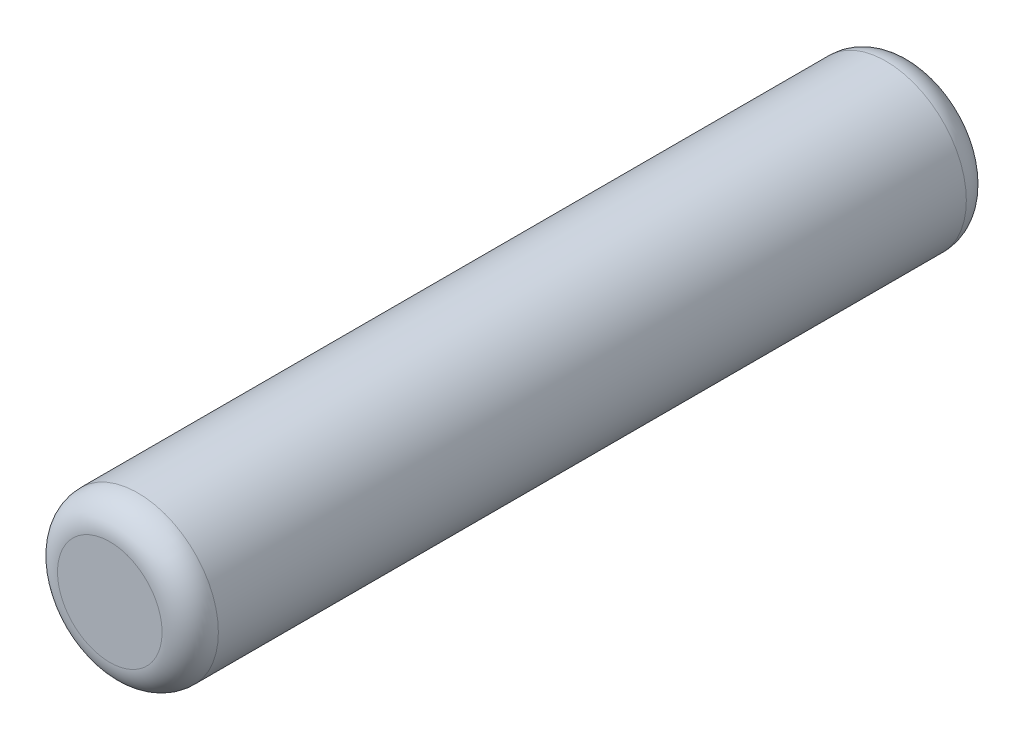
ISO-10303-21;
HEADER;
FILE_DESCRIPTION(('STEP AP214'),'2;1');
FILE_NAME('part.step','',(''),(''),'','','');
FILE_SCHEMA(('AUTOMOTIVE_DESIGN { 1 0 10303 214 1 1 1 1 }'));
ENDSEC;
DATA;
#1=APPLICATION_CONTEXT('core data for automotive mechanical design processes');
#2=APPLICATION_PROTOCOL_DEFINITION('international standard','automotive_design',2000,#1);
#3=PRODUCT_CONTEXT('',#1,'mechanical');
#4=PRODUCT('Part','Part','',(#3));
#5=PRODUCT_RELATED_PRODUCT_CATEGORY('part','',(#4));
#6=PRODUCT_DEFINITION_FORMATION('','',#4);
#7=PRODUCT_DEFINITION_CONTEXT('part definition',#1,'design');
#8=PRODUCT_DEFINITION('design','',#6,#7);
#9=PRODUCT_DEFINITION_SHAPE('','',#8);
#10=(LENGTH_UNIT() NAMED_UNIT(*) SI_UNIT(.MILLI.,.METRE.));
#11=(NAMED_UNIT(*) PLANE_ANGLE_UNIT() SI_UNIT($,.RADIAN.));
#12=(NAMED_UNIT(*) SI_UNIT($,.STERADIAN.) SOLID_ANGLE_UNIT());
#13=UNCERTAINTY_MEASURE_WITH_UNIT(LENGTH_MEASURE(1.E-05),#10,'distance_accuracy_value','');
#14=(GEOMETRIC_REPRESENTATION_CONTEXT(3) GLOBAL_UNCERTAINTY_ASSIGNED_CONTEXT((#13)) GLOBAL_UNIT_ASSIGNED_CONTEXT((#10,
#11,#12)) REPRESENTATION_CONTEXT('',''));
#15=CARTESIAN_POINT('',(0.,0.,0.));
#16=DIRECTION('',(0.,0.,1.));
#17=DIRECTION('',(1.,0.,0.));
#18=AXIS2_PLACEMENT_3D('',#15,#16,#17);
#19=CARTESIAN_POINT('',(0.,0.,5.));
#20=DIRECTION('',(0.,0.,-1.));
#21=DIRECTION('',(-1.,0.,0.));
#22=AXIS2_PLACEMENT_3D('',#19,#20,#21);
#23=CYLINDRICAL_SURFACE('',#22,1.);
#24=CARTESIAN_POINT('',(0.,0.,-4.65));
#25=DIRECTION('',(0.,0.,1.));
#26=DIRECTION('',(1.,0.,0.));
#27=AXIS2_PLACEMENT_3D('',#24,#25,#26);
#28=CIRCLE('',#27,1.);
#29=CARTESIAN_POINT('',(1.,0.,-4.65));
#30=VERTEX_POINT('',#29);
#31=EDGE_CURVE('E42',#30,#30,#28,.T.);
#32=ORIENTED_EDGE('',*,*,#31,.T.);
#33=EDGE_LOOP('',(#32));
#34=FACE_BOUND('',#33,.T.);
#35=CARTESIAN_POINT('',(0.,0.,4.65));
#36=DIRECTION('',(0.,0.,1.));
#37=DIRECTION('',(1.,0.,0.));
#38=AXIS2_PLACEMENT_3D('',#35,#36,#37);
#39=CIRCLE('',#38,1.);
#40=CARTESIAN_POINT('',(1.,0.,4.65));
#41=VERTEX_POINT('',#40);
#42=EDGE_CURVE('E46',#41,#41,#39,.F.);
#43=ORIENTED_EDGE('',*,*,#42,.T.);
#44=EDGE_LOOP('',(#43));
#45=FACE_BOUND('',#44,.T.);
#46=ADVANCED_FACE('F31',(#34,#45),#23,.T.);
#47=CARTESIAN_POINT('',(0.,0.,5.));
#48=DIRECTION('',(0.,0.,1.));
#49=DIRECTION('',(1.,0.,0.));
#50=AXIS2_PLACEMENT_3D('',#47,#48,#49);
#51=PLANE('',#50);
#52=CARTESIAN_POINT('',(0.,0.,5.));
#53=DIRECTION('',(0.,0.,1.));
#54=DIRECTION('',(1.,0.,0.));
#55=AXIS2_PLACEMENT_3D('',#52,#53,#54);
#56=CIRCLE('',#55,0.65);
#57=CARTESIAN_POINT('',(0.65,0.,5.));
#58=VERTEX_POINT('',#57);
#59=EDGE_CURVE('E10',#58,#58,#56,.T.);
#60=ORIENTED_EDGE('',*,*,#59,.T.);
#61=EDGE_LOOP('',(#60));
#62=FACE_BOUND('',#61,.T.);
#63=ADVANCED_FACE('F62',(#62),#51,.T.);
#64=CARTESIAN_POINT('',(0.,0.,-5.));
#65=DIRECTION('',(0.,0.,1.));
#66=DIRECTION('',(1.,0.,0.));
#67=AXIS2_PLACEMENT_3D('',#64,#65,#66);
#68=PLANE('',#67);
#69=CARTESIAN_POINT('',(0.,0.,-5.));
#70=DIRECTION('',(0.,0.,1.));
#71=DIRECTION('',(1.,0.,0.));
#72=AXIS2_PLACEMENT_3D('',#69,#70,#71);
#73=CIRCLE('',#72,0.65);
#74=CARTESIAN_POINT('',(0.65,0.,-5.));
#75=VERTEX_POINT('',#74);
#76=EDGE_CURVE('E38',#75,#75,#73,.F.);
#77=ORIENTED_EDGE('',*,*,#76,.T.);
#78=EDGE_LOOP('',(#77));
#79=FACE_BOUND('',#78,.T.);
#80=ADVANCED_FACE('F59',(#79),#68,.F.);
#81=CARTESIAN_POINT('',(0.,0.,-4.65));
#82=DIRECTION('',(0.,0.,1.));
#83=DIRECTION('',(1.,0.,0.));
#84=AXIS2_PLACEMENT_3D('',#81,#82,#83);
#85=TOROIDAL_SURFACE('',#84,0.65,0.35);
#86=ORIENTED_EDGE('',*,*,#76,.F.);
#87=EDGE_LOOP('',(#86));
#88=FACE_BOUND('',#87,.T.);
#89=ORIENTED_EDGE('',*,*,#31,.F.);
#90=EDGE_LOOP('',(#89));
#91=FACE_BOUND('',#90,.T.);
#92=ADVANCED_FACE('F55',(#88,#91),#85,.T.);
#93=CARTESIAN_POINT('',(0.,0.,4.65));
#94=DIRECTION('',(0.,0.,1.));
#95=DIRECTION('',(1.,0.,0.));
#96=AXIS2_PLACEMENT_3D('',#93,#94,#95);
#97=TOROIDAL_SURFACE('',#96,0.65,0.35);
#98=ORIENTED_EDGE('',*,*,#42,.F.);
#99=EDGE_LOOP('',(#98));
#100=FACE_BOUND('',#99,.T.);
#101=ORIENTED_EDGE('',*,*,#59,.F.);
#102=EDGE_LOOP('',(#101));
#103=FACE_BOUND('',#102,.T.);
#104=ADVANCED_FACE('F33',(#100,#103),#97,.T.);
#105=CLOSED_SHELL('',(#46,#63,#80,#92,#104));
#106=MANIFOLD_SOLID_BREP('B2',#105);
#107=ADVANCED_BREP_SHAPE_REPRESENTATION('',(#18,#106),#14);
#108=SHAPE_DEFINITION_REPRESENTATION(#9,#107);
ENDSEC;
END-ISO-10303-21;
